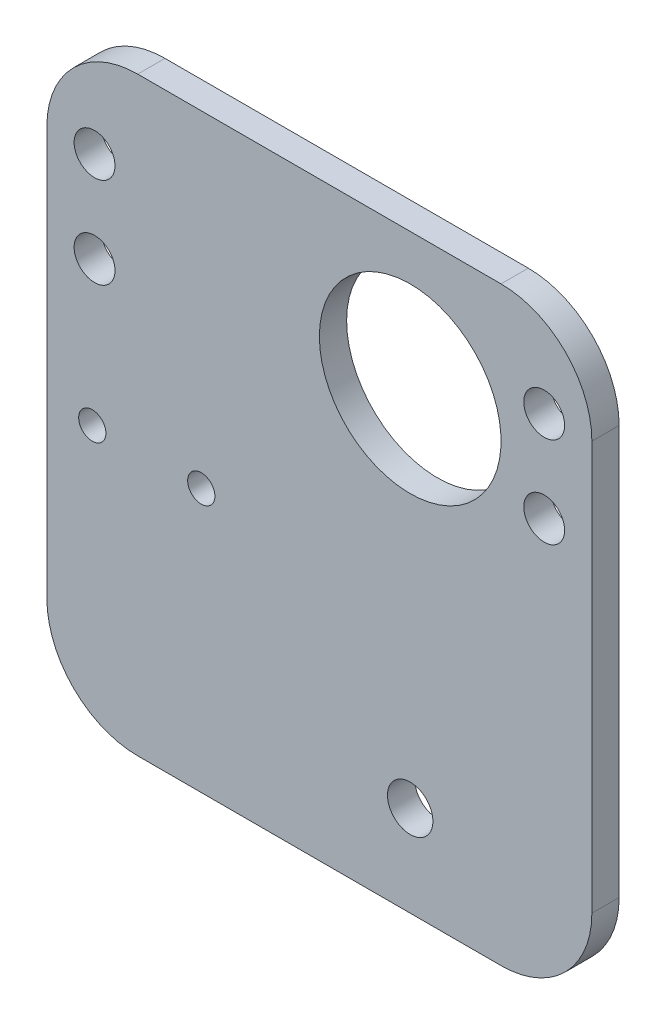
ISO-10303-21;
HEADER;
FILE_DESCRIPTION(('STEP AP214'),'2;1');
FILE_NAME('part.step','',(''),(''),'','','');
FILE_SCHEMA(('AUTOMOTIVE_DESIGN { 1 0 10303 214 1 1 1 1 }'));
ENDSEC;
DATA;
#1=APPLICATION_CONTEXT('core data for automotive mechanical design processes');
#2=APPLICATION_PROTOCOL_DEFINITION('international standard','automotive_design',2000,#1);
#3=PRODUCT_CONTEXT('',#1,'mechanical');
#4=PRODUCT('Part','Part','',(#3));
#5=PRODUCT_RELATED_PRODUCT_CATEGORY('part','',(#4));
#6=PRODUCT_DEFINITION_FORMATION('','',#4);
#7=PRODUCT_DEFINITION_CONTEXT('part definition',#1,'design');
#8=PRODUCT_DEFINITION('design','',#6,#7);
#9=PRODUCT_DEFINITION_SHAPE('','',#8);
#10=(LENGTH_UNIT() NAMED_UNIT(*) SI_UNIT(.MILLI.,.METRE.));
#11=(NAMED_UNIT(*) PLANE_ANGLE_UNIT() SI_UNIT($,.RADIAN.));
#12=(NAMED_UNIT(*) SI_UNIT($,.STERADIAN.) SOLID_ANGLE_UNIT());
#13=UNCERTAINTY_MEASURE_WITH_UNIT(LENGTH_MEASURE(1.E-05),#10,'distance_accuracy_value','');
#14=(GEOMETRIC_REPRESENTATION_CONTEXT(3) GLOBAL_UNCERTAINTY_ASSIGNED_CONTEXT((#13)) GLOBAL_UNIT_ASSIGNED_CONTEXT((#10,
#11,#12)) REPRESENTATION_CONTEXT('',''));
#15=CARTESIAN_POINT('',(0.,0.,0.));
#16=DIRECTION('',(0.,0.,1.));
#17=DIRECTION('',(1.,0.,0.));
#18=AXIS2_PLACEMENT_3D('',#15,#16,#17);
#19=CARTESIAN_POINT('',(0.,0.,0.001));
#20=DIRECTION('',(0.,0.,1.));
#21=DIRECTION('',(1.,0.,0.));
#22=AXIS2_PLACEMENT_3D('',#19,#20,#21);
#23=PLANE('',#22);
#24=CARTESIAN_POINT('',(45.5164785410153,-28.4674981786718,0.001));
#25=DIRECTION('',(0.,0.,-1.));
#26=DIRECTION('',(-1.,0.,0.));
#27=AXIS2_PLACEMENT_3D('',#24,#25,#26);
#28=CIRCLE('',#27,2.5);
#29=CARTESIAN_POINT('',(43.0164785410153,-28.4674981786718,0.001));
#30=VERTEX_POINT('',#29);
#31=EDGE_CURVE('E264',#30,#30,#28,.T.);
#32=ORIENTED_EDGE('',*,*,#31,.F.);
#33=EDGE_LOOP('',(#32));
#34=FACE_BOUND('',#33,.T.);
#35=CARTESIAN_POINT('',(45.5164785410153,-28.4674981786718,0.000999999999999916));
#36=DIRECTION('',(0.,0.,1.));
#37=DIRECTION('',(1.,0.,0.));
#38=AXIS2_PLACEMENT_3D('',#35,#36,#37);
#39=CIRCLE('',#38,7.5);
#40=CARTESIAN_POINT('',(53.0164785410153,-28.4674981786718,0.000999999999999916));
#41=VERTEX_POINT('',#40);
#42=EDGE_CURVE('E127',#41,#41,#39,.T.);
#43=ORIENTED_EDGE('',*,*,#42,.F.);
#44=EDGE_LOOP('',(#43));
#45=FACE_BOUND('',#44,.T.);
#46=ADVANCED_FACE('F35',(#34,#45),#23,.F.);
#47=CARTESIAN_POINT('',(45.5164785410153,-28.4674981786718,0.000999999999999916));
#48=DIRECTION('',(0.,0.,1.));
#49=DIRECTION('',(1.,0.,0.));
#50=AXIS2_PLACEMENT_3D('',#47,#48,#49);
#51=CIRCLE('',#50,9.5);
#52=CARTESIAN_POINT('',(55.0164785410153,-28.4674981786718,0.000999999999999916));
#53=VERTEX_POINT('',#52);
#54=EDGE_CURVE('E377',#53,#53,#51,.T.);
#55=ORIENTED_EDGE('',*,*,#54,.T.);
#56=EDGE_LOOP('',(#55));
#57=FACE_BOUND('',#56,.T.);
#58=CARTESIAN_POINT('',(10.5164785410153,-9.46749817867184,0.00100000000000013));
#59=DIRECTION('',(0.,0.,1.));
#60=DIRECTION('',(1.,0.,0.));
#61=AXIS2_PLACEMENT_3D('',#58,#59,#60);
#62=CIRCLE('',#61,1.5);
#63=CARTESIAN_POINT('',(12.0164785410153,-9.46749817867184,0.00100000000000013));
#64=VERTEX_POINT('',#63);
#65=EDGE_CURVE('E270',#64,#64,#62,.T.);
#66=ORIENTED_EDGE('',*,*,#65,.T.);
#67=EDGE_LOOP('',(#66));
#68=FACE_BOUND('',#67,.T.);
#69=CARTESIAN_POINT('',(22.5164785410153,-9.46749817867184,0.00100000000000013));
#70=DIRECTION('',(0.,0.,1.));
#71=DIRECTION('',(1.,0.,0.));
#72=AXIS2_PLACEMENT_3D('',#69,#70,#71);
#73=CIRCLE('',#72,1.5);
#74=CARTESIAN_POINT('',(24.0164785410153,-9.46749817867184,0.00100000000000013));
#75=VERTEX_POINT('',#74);
#76=EDGE_CURVE('E385',#75,#75,#73,.T.);
#77=ORIENTED_EDGE('',*,*,#76,.T.);
#78=EDGE_LOOP('',(#77));
#79=FACE_BOUND('',#78,.T.);
#80=CARTESIAN_POINT('',(45.5164785410153,11.5325018213282,0.001));
#81=DIRECTION('',(0.,0.,-1.));
#82=DIRECTION('',(-1.,0.,0.));
#83=AXIS2_PLACEMENT_3D('',#80,#81,#82);
#84=CIRCLE('',#83,10.);
#85=CARTESIAN_POINT('',(35.5164785410153,11.5325018213282,0.001));
#86=VERTEX_POINT('',#85);
#87=EDGE_CURVE('E263',#86,#86,#84,.T.);
#88=ORIENTED_EDGE('',*,*,#87,.F.);
#89=EDGE_LOOP('',(#88));
#90=FACE_BOUND('',#89,.T.);
#91=CARTESIAN_POINT('',(60.2664785410153,6.53250182132816,0.001));
#92=DIRECTION('',(0.,0.,1.));
#93=DIRECTION('',(1.,0.,0.));
#94=AXIS2_PLACEMENT_3D('',#91,#92,#93);
#95=CIRCLE('',#94,3.00000000000002);
#96=CARTESIAN_POINT('',(63.2664785410153,6.53250182132816,0.001));
#97=VERTEX_POINT('',#96);
#98=EDGE_CURVE('E187',#97,#97,#95,.F.);
#99=ORIENTED_EDGE('',*,*,#98,.F.);
#100=EDGE_LOOP('',(#99));
#101=FACE_BOUND('',#100,.T.);
#102=DIRECTION('',(1.,0.,0.));
#103=VECTOR('',#102,1.);
#104=CARTESIAN_POINT('',(5.51647854101529,26.5325018213282,0.001));
#105=LINE('',#104,#103);
#106=CARTESIAN_POINT('',(15.5164785410153,26.5325018213282,0.001));
#107=VERTEX_POINT('',#106);
#108=CARTESIAN_POINT('',(55.5164785410153,26.5325018213282,0.001));
#109=VERTEX_POINT('',#108);
#110=EDGE_CURVE('E105',#107,#109,#105,.T.);
#111=ORIENTED_EDGE('',*,*,#110,.T.);
#112=CARTESIAN_POINT('',(55.5164785410153,16.5325018213282,0.00100000000000013));
#113=DIRECTION('',(0.,0.,1.));
#114=DIRECTION('',(1.,0.,0.));
#115=AXIS2_PLACEMENT_3D('',#112,#113,#114);
#116=CIRCLE('',#115,10.);
#117=CARTESIAN_POINT('',(65.5164785410153,16.5325018213282,0.001));
#118=VERTEX_POINT('',#117);
#119=EDGE_CURVE('E139',#109,#118,#116,.F.);
#120=ORIENTED_EDGE('',*,*,#119,.T.);
#121=DIRECTION('',(0.,-1.,0.));
#122=VECTOR('',#121,1.);
#123=CARTESIAN_POINT('',(65.5164785410153,26.5325018213282,0.001));
#124=LINE('',#123,#122);
#125=CARTESIAN_POINT('',(65.5164785410153,-28.4674981786718,0.001));
#126=VERTEX_POINT('',#125);
#127=EDGE_CURVE('E123',#118,#126,#124,.T.);
#128=ORIENTED_EDGE('',*,*,#127,.T.);
#129=CARTESIAN_POINT('',(55.5164785410153,-28.4674981786718,0.00100000000000013));
#130=DIRECTION('',(0.,0.,1.));
#131=DIRECTION('',(1.,0.,0.));
#132=AXIS2_PLACEMENT_3D('',#129,#130,#131);
#133=CIRCLE('',#132,10.);
#134=CARTESIAN_POINT('',(55.5164785410153,-38.4674981786718,0.001));
#135=VERTEX_POINT('',#134);
#136=EDGE_CURVE('E137',#126,#135,#133,.F.);
#137=ORIENTED_EDGE('',*,*,#136,.T.);
#138=DIRECTION('',(1.,0.,0.));
#139=VECTOR('',#138,1.);
#140=CARTESIAN_POINT('',(5.51647854101529,-38.4674981786718,0.001));
#141=LINE('',#140,#139);
#142=CARTESIAN_POINT('',(15.5164785410153,-38.4674981786718,0.001));
#143=VERTEX_POINT('',#142);
#144=EDGE_CURVE('E173',#143,#135,#141,.T.);
#145=ORIENTED_EDGE('',*,*,#144,.F.);
#146=CARTESIAN_POINT('',(15.5164785410153,-28.4674981786718,0.00100000000000013));
#147=DIRECTION('',(0.,0.,1.));
#148=DIRECTION('',(1.,0.,0.));
#149=AXIS2_PLACEMENT_3D('',#146,#147,#148);
#150=CIRCLE('',#149,10.);
#151=CARTESIAN_POINT('',(5.51647854101529,-28.4674981786718,0.001));
#152=VERTEX_POINT('',#151);
#153=EDGE_CURVE('E112',#143,#152,#150,.F.);
#154=ORIENTED_EDGE('',*,*,#153,.T.);
#155=DIRECTION('',(0.,-1.,0.));
#156=VECTOR('',#155,1.);
#157=CARTESIAN_POINT('',(5.51647854101529,1.53250182132815,0.001));
#158=LINE('',#157,#156);
#159=CARTESIAN_POINT('',(5.51647854101529,16.5325018213282,0.001));
#160=VERTEX_POINT('',#159);
#161=EDGE_CURVE('E107',#160,#152,#158,.T.);
#162=ORIENTED_EDGE('',*,*,#161,.F.);
#163=CARTESIAN_POINT('',(15.5164785410153,16.5325018213282,0.00100000000000013));
#164=DIRECTION('',(0.,0.,1.));
#165=DIRECTION('',(1.,0.,0.));
#166=AXIS2_PLACEMENT_3D('',#163,#164,#165);
#167=CIRCLE('',#166,10.);
#168=EDGE_CURVE('E101',#160,#107,#167,.F.);
#169=ORIENTED_EDGE('',*,*,#168,.T.);
#170=EDGE_LOOP('',(#111,#120,#128,#137,#145,#154,#162,#169));
#171=FACE_BOUND('',#170,.T.);
#172=CARTESIAN_POINT('',(10.7664785410153,6.53250182132816,0.001));
#173=DIRECTION('',(0.,0.,1.));
#174=DIRECTION('',(1.,0.,0.));
#175=AXIS2_PLACEMENT_3D('',#172,#173,#174);
#176=CIRCLE('',#175,3.);
#177=CARTESIAN_POINT('',(13.7664785410153,6.53250182132816,0.001));
#178=VERTEX_POINT('',#177);
#179=EDGE_CURVE('E180',#178,#178,#176,.T.);
#180=ORIENTED_EDGE('',*,*,#179,.T.);
#181=EDGE_LOOP('',(#180));
#182=FACE_BOUND('',#181,.T.);
#183=CARTESIAN_POINT('',(60.2664785410153,16.5325018213282,0.001));
#184=DIRECTION('',(0.,0.,1.));
#185=DIRECTION('',(1.,0.,0.));
#186=AXIS2_PLACEMENT_3D('',#183,#184,#185);
#187=CIRCLE('',#186,3.00000000000002);
#188=CARTESIAN_POINT('',(63.2664785410153,16.5325018213282,0.001));
#189=VERTEX_POINT('',#188);
#190=EDGE_CURVE('E183',#189,#189,#187,.F.);
#191=ORIENTED_EDGE('',*,*,#190,.F.);
#192=EDGE_LOOP('',(#191));
#193=FACE_BOUND('',#192,.T.);
#194=CARTESIAN_POINT('',(10.7664785410153,16.5325018213282,0.001));
#195=DIRECTION('',(0.,0.,1.));
#196=DIRECTION('',(1.,0.,0.));
#197=AXIS2_PLACEMENT_3D('',#194,#195,#196);
#198=CIRCLE('',#197,3.);
#199=CARTESIAN_POINT('',(13.7664785410153,16.5325018213282,0.001));
#200=VERTEX_POINT('',#199);
#201=EDGE_CURVE('E131',#200,#200,#198,.F.);
#202=ORIENTED_EDGE('',*,*,#201,.F.);
#203=EDGE_LOOP('',(#202));
#204=FACE_BOUND('',#203,.T.);
#205=ADVANCED_FACE('F103',(#57,#68,#79,#90,#101,#171,#182,#193,#204),#23,.F.);
#206=CARTESIAN_POINT('',(10.7664785410153,6.53250182132816,0.001));
#207=DIRECTION('',(0.,0.,-1.));
#208=DIRECTION('',(-1.,0.,0.));
#209=AXIS2_PLACEMENT_3D('',#206,#207,#208);
#210=CYLINDRICAL_SURFACE('',#209,3.);
#211=ORIENTED_EDGE('',*,*,#179,.F.);
#212=EDGE_LOOP('',(#211));
#213=FACE_BOUND('',#212,.T.);
#214=CARTESIAN_POINT('',(10.7664785410153,6.53250182132816,0.));
#215=DIRECTION('',(0.,0.,1.));
#216=DIRECTION('',(1.,0.,0.));
#217=AXIS2_PLACEMENT_3D('',#214,#215,#216);
#218=CIRCLE('',#217,3.);
#219=CARTESIAN_POINT('',(13.7664785410153,6.53250182132816,0.));
#220=VERTEX_POINT('',#219);
#221=EDGE_CURVE('E179',#220,#220,#218,.T.);
#222=ORIENTED_EDGE('',*,*,#221,.T.);
#223=EDGE_LOOP('',(#222));
#224=FACE_BOUND('',#223,.T.);
#225=ADVANCED_FACE('F198',(#213,#224),#210,.T.);
#226=CARTESIAN_POINT('',(10.7664785410153,6.53250182132816,0.));
#227=DIRECTION('',(0.,0.,1.));
#228=DIRECTION('',(1.,0.,0.));
#229=AXIS2_PLACEMENT_3D('',#226,#227,#228);
#230=PLANE('',#229);
#231=CARTESIAN_POINT('',(10.7664785410153,6.53250182132816,0.));
#232=DIRECTION('',(0.,0.,1.));
#233=DIRECTION('',(1.,0.,0.));
#234=AXIS2_PLACEMENT_3D('',#231,#232,#233);
#235=CIRCLE('',#234,2.25);
#236=CARTESIAN_POINT('',(13.0164785410153,6.53250182132816,0.));
#237=VERTEX_POINT('',#236);
#238=EDGE_CURVE('E171',#237,#237,#235,.T.);
#239=ORIENTED_EDGE('',*,*,#238,.T.);
#240=EDGE_LOOP('',(#239));
#241=FACE_BOUND('',#240,.T.);
#242=ORIENTED_EDGE('',*,*,#221,.F.);
#243=EDGE_LOOP('',(#242));
#244=FACE_BOUND('',#243,.T.);
#245=ADVANCED_FACE('F205',(#241,#244),#230,.F.);
#246=CARTESIAN_POINT('',(10.7664785410153,6.53250182132816,0.));
#247=DIRECTION('',(0.,0.,1.));
#248=DIRECTION('',(1.,0.,0.));
#249=AXIS2_PLACEMENT_3D('',#246,#247,#248);
#250=CYLINDRICAL_SURFACE('',#249,2.25);
#251=ORIENTED_EDGE('',*,*,#238,.F.);
#252=EDGE_LOOP('',(#251));
#253=FACE_BOUND('',#252,.T.);
#254=CARTESIAN_POINT('',(10.7664785410153,6.53250182132816,3.001));
#255=DIRECTION('',(0.,0.,-1.));
#256=DIRECTION('',(-1.,0.,0.));
#257=AXIS2_PLACEMENT_3D('',#254,#255,#256);
#258=CIRCLE('',#257,2.25);
#259=CARTESIAN_POINT('',(8.51647854101528,6.53250182132816,3.001));
#260=VERTEX_POINT('',#259);
#261=EDGE_CURVE('E278',#260,#260,#258,.T.);
#262=ORIENTED_EDGE('',*,*,#261,.F.);
#263=EDGE_LOOP('',(#262));
#264=FACE_BOUND('',#263,.T.);
#265=ADVANCED_FACE('F227',(#253,#264),#250,.F.);
#266=CARTESIAN_POINT('',(0.,0.,3.001));
#267=DIRECTION('',(0.,0.,1.));
#268=DIRECTION('',(1.,0.,0.));
#269=AXIS2_PLACEMENT_3D('',#266,#267,#268);
#270=PLANE('',#269);
#271=CARTESIAN_POINT('',(10.5164785410153,-9.46749817867184,3.001));
#272=DIRECTION('',(0.,0.,1.));
#273=DIRECTION('',(1.,0.,0.));
#274=AXIS2_PLACEMENT_3D('',#271,#272,#273);
#275=CIRCLE('',#274,1.5);
#276=CARTESIAN_POINT('',(12.0164785410153,-9.46749817867184,3.001));
#277=VERTEX_POINT('',#276);
#278=EDGE_CURVE('E382',#277,#277,#275,.T.);
#279=ORIENTED_EDGE('',*,*,#278,.F.);
#280=EDGE_LOOP('',(#279));
#281=FACE_BOUND('',#280,.T.);
#282=CARTESIAN_POINT('',(22.5164785410153,-9.46749817867184,3.001));
#283=DIRECTION('',(0.,0.,1.));
#284=DIRECTION('',(1.,0.,0.));
#285=AXIS2_PLACEMENT_3D('',#282,#283,#284);
#286=CIRCLE('',#285,1.5);
#287=CARTESIAN_POINT('',(24.0164785410153,-9.46749817867184,3.001));
#288=VERTEX_POINT('',#287);
#289=EDGE_CURVE('E381',#288,#288,#286,.T.);
#290=ORIENTED_EDGE('',*,*,#289,.F.);
#291=EDGE_LOOP('',(#290));
#292=FACE_BOUND('',#291,.T.);
#293=CARTESIAN_POINT('',(60.2664785410153,16.5325018213282,3.001));
#294=DIRECTION('',(0.,0.,-1.));
#295=DIRECTION('',(-1.,0.,0.));
#296=AXIS2_PLACEMENT_3D('',#293,#294,#295);
#297=CIRCLE('',#296,2.25);
#298=CARTESIAN_POINT('',(58.0164785410153,16.5325018213282,3.001));
#299=VERTEX_POINT('',#298);
#300=EDGE_CURVE('E281',#299,#299,#297,.T.);
#301=ORIENTED_EDGE('',*,*,#300,.T.);
#302=EDGE_LOOP('',(#301));
#303=FACE_BOUND('',#302,.T.);
#304=ORIENTED_EDGE('',*,*,#261,.T.);
#305=EDGE_LOOP('',(#304));
#306=FACE_BOUND('',#305,.T.);
#307=CARTESIAN_POINT('',(10.7664785410153,16.5325018213282,3.001));
#308=DIRECTION('',(0.,0.,-1.));
#309=DIRECTION('',(-1.,0.,0.));
#310=AXIS2_PLACEMENT_3D('',#307,#308,#309);
#311=CIRCLE('',#310,2.25);
#312=CARTESIAN_POINT('',(8.51647854101528,16.5325018213282,3.001));
#313=VERTEX_POINT('',#312);
#314=EDGE_CURVE('E275',#313,#313,#311,.T.);
#315=ORIENTED_EDGE('',*,*,#314,.T.);
#316=EDGE_LOOP('',(#315));
#317=FACE_BOUND('',#316,.T.);
#318=CARTESIAN_POINT('',(45.5164785410153,11.5325018213282,3.001));
#319=DIRECTION('',(0.,0.,-1.));
#320=DIRECTION('',(-1.,0.,0.));
#321=AXIS2_PLACEMENT_3D('',#318,#319,#320);
#322=CIRCLE('',#321,10.);
#323=CARTESIAN_POINT('',(35.5164785410153,11.5325018213282,3.001));
#324=VERTEX_POINT('',#323);
#325=EDGE_CURVE('E267',#324,#324,#322,.T.);
#326=ORIENTED_EDGE('',*,*,#325,.T.);
#327=EDGE_LOOP('',(#326));
#328=FACE_BOUND('',#327,.T.);
#329=CARTESIAN_POINT('',(60.2664785410153,6.53250182132816,3.001));
#330=DIRECTION('',(0.,0.,-1.));
#331=DIRECTION('',(-1.,0.,0.));
#332=AXIS2_PLACEMENT_3D('',#329,#330,#331);
#333=CIRCLE('',#332,2.25);
#334=CARTESIAN_POINT('',(58.0164785410153,6.53250182132816,3.001));
#335=VERTEX_POINT('',#334);
#336=EDGE_CURVE('E284',#335,#335,#333,.T.);
#337=ORIENTED_EDGE('',*,*,#336,.T.);
#338=EDGE_LOOP('',(#337));
#339=FACE_BOUND('',#338,.T.);
#340=DIRECTION('',(0.,-1.,0.));
#341=VECTOR('',#340,1.);
#342=CARTESIAN_POINT('',(65.5164785410153,26.5325018213282,3.001));
#343=LINE('',#342,#341);
#344=CARTESIAN_POINT('',(65.5164785410153,16.5325018213282,3.001));
#345=VERTEX_POINT('',#344);
#346=CARTESIAN_POINT('',(65.5164785410153,-28.4674981786718,3.001));
#347=VERTEX_POINT('',#346);
#348=EDGE_CURVE('E161',#345,#347,#343,.T.);
#349=ORIENTED_EDGE('',*,*,#348,.F.);
#350=CARTESIAN_POINT('',(55.5164785410153,16.5325018213282,3.001));
#351=DIRECTION('',(0.,0.,1.));
#352=DIRECTION('',(1.,0.,0.));
#353=AXIS2_PLACEMENT_3D('',#350,#351,#352);
#354=CIRCLE('',#353,10.);
#355=CARTESIAN_POINT('',(55.5164785410153,26.5325018213282,3.001));
#356=VERTEX_POINT('',#355);
#357=EDGE_CURVE('E150',#345,#356,#354,.T.);
#358=ORIENTED_EDGE('',*,*,#357,.T.);
#359=DIRECTION('',(1.,0.,0.));
#360=VECTOR('',#359,1.);
#361=CARTESIAN_POINT('',(5.51647854101529,26.5325018213282,3.001));
#362=LINE('',#361,#360);
#363=CARTESIAN_POINT('',(15.5164785410153,26.5325018213282,3.001));
#364=VERTEX_POINT('',#363);
#365=EDGE_CURVE('E169',#364,#356,#362,.T.);
#366=ORIENTED_EDGE('',*,*,#365,.F.);
#367=CARTESIAN_POINT('',(15.5164785410153,16.5325018213282,3.001));
#368=DIRECTION('',(0.,0.,1.));
#369=DIRECTION('',(1.,0.,0.));
#370=AXIS2_PLACEMENT_3D('',#367,#368,#369);
#371=CIRCLE('',#370,10.);
#372=CARTESIAN_POINT('',(5.51647854101529,16.5325018213282,3.001));
#373=VERTEX_POINT('',#372);
#374=EDGE_CURVE('E126',#364,#373,#371,.T.);
#375=ORIENTED_EDGE('',*,*,#374,.T.);
#376=DIRECTION('',(0.,-1.,0.));
#377=VECTOR('',#376,1.);
#378=CARTESIAN_POINT('',(5.51647854101529,26.5325018213282,3.001));
#379=LINE('',#378,#377);
#380=CARTESIAN_POINT('',(5.51647854101529,-28.4674981786718,3.001));
#381=VERTEX_POINT('',#380);
#382=EDGE_CURVE('E122',#373,#381,#379,.T.);
#383=ORIENTED_EDGE('',*,*,#382,.T.);
#384=CARTESIAN_POINT('',(15.5164785410153,-28.4674981786718,3.001));
#385=DIRECTION('',(0.,0.,1.));
#386=DIRECTION('',(1.,0.,0.));
#387=AXIS2_PLACEMENT_3D('',#384,#385,#386);
#388=CIRCLE('',#387,10.);
#389=CARTESIAN_POINT('',(15.5164785410153,-38.4674981786718,3.001));
#390=VERTEX_POINT('',#389);
#391=EDGE_CURVE('E57',#381,#390,#388,.T.);
#392=ORIENTED_EDGE('',*,*,#391,.T.);
#393=DIRECTION('',(1.,0.,0.));
#394=VECTOR('',#393,1.);
#395=CARTESIAN_POINT('',(5.51647854101529,-38.4674981786718,3.001));
#396=LINE('',#395,#394);
#397=CARTESIAN_POINT('',(55.5164785410153,-38.4674981786718,3.001));
#398=VERTEX_POINT('',#397);
#399=EDGE_CURVE('E159',#390,#398,#396,.T.);
#400=ORIENTED_EDGE('',*,*,#399,.T.);
#401=CARTESIAN_POINT('',(55.5164785410153,-28.4674981786718,3.001));
#402=DIRECTION('',(0.,0.,1.));
#403=DIRECTION('',(1.,0.,0.));
#404=AXIS2_PLACEMENT_3D('',#401,#402,#403);
#405=CIRCLE('',#404,10.);
#406=EDGE_CURVE('E148',#398,#347,#405,.T.);
#407=ORIENTED_EDGE('',*,*,#406,.T.);
#408=EDGE_LOOP('',(#349,#358,#366,#375,#383,#392,#400,#407));
#409=FACE_BOUND('',#408,.T.);
#410=CARTESIAN_POINT('',(45.5164785410153,-28.4674981786718,3.001));
#411=DIRECTION('',(0.,0.,-1.));
#412=DIRECTION('',(-1.,0.,0.));
#413=AXIS2_PLACEMENT_3D('',#410,#411,#412);
#414=CIRCLE('',#413,2.5);
#415=CARTESIAN_POINT('',(43.0164785410153,-28.4674981786718,3.001));
#416=VERTEX_POINT('',#415);
#417=EDGE_CURVE('E261',#416,#416,#414,.T.);
#418=ORIENTED_EDGE('',*,*,#417,.T.);
#419=EDGE_LOOP('',(#418));
#420=FACE_BOUND('',#419,.T.);
#421=ADVANCED_FACE('F213',(#281,#292,#303,#306,#317,#328,#339,#409,#420),#270,.T.);
#422=CARTESIAN_POINT('',(5.51647854101529,26.5325018213282,3.001));
#423=DIRECTION('',(0.,1.,0.));
#424=DIRECTION('',(0.,0.,1.));
#425=AXIS2_PLACEMENT_3D('',#422,#423,#424);
#426=PLANE('',#425);
#427=ORIENTED_EDGE('',*,*,#365,.T.);
#428=DIRECTION('',(0.,0.,-1.));
#429=VECTOR('',#428,1.);
#430=CARTESIAN_POINT('',(55.5164785410153,26.5325018213282,3.001));
#431=LINE('',#430,#429);
#432=EDGE_CURVE('E113',#356,#109,#431,.T.);
#433=ORIENTED_EDGE('',*,*,#432,.T.);
#434=ORIENTED_EDGE('',*,*,#110,.F.);
#435=DIRECTION('',(0.,0.,-1.));
#436=VECTOR('',#435,1.);
#437=CARTESIAN_POINT('',(15.5164785410153,26.5325018213282,3.001));
#438=LINE('',#437,#436);
#439=EDGE_CURVE('E119',#107,#364,#438,.F.);
#440=ORIENTED_EDGE('',*,*,#439,.T.);
#441=EDGE_LOOP('',(#427,#433,#434,#440));
#442=FACE_BOUND('',#441,.T.);
#443=ADVANCED_FACE('F118',(#442),#426,.T.);
#444=CARTESIAN_POINT('',(65.5164785410153,26.5325018213282,3.001));
#445=DIRECTION('',(1.,0.,0.));
#446=DIRECTION('',(0.,0.,-1.));
#447=AXIS2_PLACEMENT_3D('',#444,#445,#446);
#448=PLANE('',#447);
#449=ORIENTED_EDGE('',*,*,#127,.F.);
#450=DIRECTION('',(0.,0.,-1.));
#451=VECTOR('',#450,1.);
#452=CARTESIAN_POINT('',(65.5164785410153,16.5325018213282,3.001));
#453=LINE('',#452,#451);
#454=EDGE_CURVE('E144',#118,#345,#453,.F.);
#455=ORIENTED_EDGE('',*,*,#454,.T.);
#456=ORIENTED_EDGE('',*,*,#348,.T.);
#457=DIRECTION('',(0.,0.,-1.));
#458=VECTOR('',#457,1.);
#459=CARTESIAN_POINT('',(65.5164785410153,-28.4674981786718,0.00100000000000013));
#460=LINE('',#459,#458);
#461=EDGE_CURVE('E141',#347,#126,#460,.T.);
#462=ORIENTED_EDGE('',*,*,#461,.T.);
#463=EDGE_LOOP('',(#449,#455,#456,#462));
#464=FACE_BOUND('',#463,.T.);
#465=ADVANCED_FACE('F217',(#464),#448,.T.);
#466=CARTESIAN_POINT('',(5.51647854101529,-38.4674981786718,3.001));
#467=DIRECTION('',(0.,1.,0.));
#468=DIRECTION('',(0.,0.,1.));
#469=AXIS2_PLACEMENT_3D('',#466,#467,#468);
#470=PLANE('',#469);
#471=ORIENTED_EDGE('',*,*,#144,.T.);
#472=DIRECTION('',(0.,0.,-1.));
#473=VECTOR('',#472,1.);
#474=CARTESIAN_POINT('',(55.5164785410153,-38.4674981786718,3.001));
#475=LINE('',#474,#473);
#476=EDGE_CURVE('E50',#135,#398,#475,.F.);
#477=ORIENTED_EDGE('',*,*,#476,.T.);
#478=ORIENTED_EDGE('',*,*,#399,.F.);
#479=DIRECTION('',(0.,0.,-1.));
#480=VECTOR('',#479,1.);
#481=CARTESIAN_POINT('',(15.5164785410153,-38.4674981786718,3.001));
#482=LINE('',#481,#480);
#483=EDGE_CURVE('E152',#390,#143,#482,.T.);
#484=ORIENTED_EDGE('',*,*,#483,.T.);
#485=EDGE_LOOP('',(#471,#477,#478,#484));
#486=FACE_BOUND('',#485,.T.);
#487=ADVANCED_FACE('F220',(#486),#470,.F.);
#488=CARTESIAN_POINT('',(5.51647854101529,1.53250182132815,3.001));
#489=DIRECTION('',(1.,0.,0.));
#490=DIRECTION('',(0.,1.,0.));
#491=AXIS2_PLACEMENT_3D('',#488,#489,#490);
#492=PLANE('',#491);
#493=ORIENTED_EDGE('',*,*,#161,.T.);
#494=DIRECTION('',(0.,0.,-1.));
#495=VECTOR('',#494,1.);
#496=CARTESIAN_POINT('',(5.51647854101529,-28.4674981786718,3.001));
#497=LINE('',#496,#495);
#498=EDGE_CURVE('E11',#152,#381,#497,.F.);
#499=ORIENTED_EDGE('',*,*,#498,.T.);
#500=ORIENTED_EDGE('',*,*,#382,.F.);
#501=DIRECTION('',(0.,0.,-1.));
#502=VECTOR('',#501,1.);
#503=CARTESIAN_POINT('',(5.51647854101529,16.5325018213282,0.00100000000000013));
#504=LINE('',#503,#502);
#505=EDGE_CURVE('E43',#373,#160,#504,.T.);
#506=ORIENTED_EDGE('',*,*,#505,.T.);
#507=EDGE_LOOP('',(#493,#499,#500,#506));
#508=FACE_BOUND('',#507,.T.);
#509=ADVANCED_FACE('F157',(#508),#492,.F.);
#510=CARTESIAN_POINT('',(60.2664785410153,16.5325018213282,0.001));
#511=DIRECTION('',(0.,0.,-1.));
#512=DIRECTION('',(-1.,0.,0.));
#513=AXIS2_PLACEMENT_3D('',#510,#511,#512);
#514=CYLINDRICAL_SURFACE('',#513,3.00000000000002);
#515=ORIENTED_EDGE('',*,*,#190,.T.);
#516=EDGE_LOOP('',(#515));
#517=FACE_BOUND('',#516,.T.);
#518=CARTESIAN_POINT('',(60.2664785410153,16.5325018213282,0.));
#519=DIRECTION('',(0.,0.,1.));
#520=DIRECTION('',(1.,0.,0.));
#521=AXIS2_PLACEMENT_3D('',#518,#519,#520);
#522=CIRCLE('',#521,3.00000000000002);
#523=CARTESIAN_POINT('',(63.2664785410153,16.5325018213282,0.));
#524=VERTEX_POINT('',#523);
#525=EDGE_CURVE('E164',#524,#524,#522,.T.);
#526=ORIENTED_EDGE('',*,*,#525,.T.);
#527=EDGE_LOOP('',(#526));
#528=FACE_BOUND('',#527,.T.);
#529=ADVANCED_FACE('F226',(#517,#528),#514,.T.);
#530=CARTESIAN_POINT('',(60.2664785410153,16.5325018213282,0.));
#531=DIRECTION('',(0.,0.,1.));
#532=DIRECTION('',(1.,0.,0.));
#533=AXIS2_PLACEMENT_3D('',#530,#531,#532);
#534=PLANE('',#533);
#535=CARTESIAN_POINT('',(60.2664785410153,16.5325018213282,0.));
#536=DIRECTION('',(0.,0.,1.));
#537=DIRECTION('',(1.,0.,0.));
#538=AXIS2_PLACEMENT_3D('',#535,#536,#537);
#539=CIRCLE('',#538,2.25);
#540=CARTESIAN_POINT('',(62.5164785410153,16.5325018213282,0.));
#541=VERTEX_POINT('',#540);
#542=EDGE_CURVE('E300',#541,#541,#539,.T.);
#543=ORIENTED_EDGE('',*,*,#542,.T.);
#544=EDGE_LOOP('',(#543));
#545=FACE_BOUND('',#544,.T.);
#546=ORIENTED_EDGE('',*,*,#525,.F.);
#547=EDGE_LOOP('',(#546));
#548=FACE_BOUND('',#547,.T.);
#549=ADVANCED_FACE('F308',(#545,#548),#534,.F.);
#550=CARTESIAN_POINT('',(60.2664785410153,16.5325018213282,0.));
#551=DIRECTION('',(0.,0.,1.));
#552=DIRECTION('',(1.,0.,0.));
#553=AXIS2_PLACEMENT_3D('',#550,#551,#552);
#554=CYLINDRICAL_SURFACE('',#553,2.25);
#555=ORIENTED_EDGE('',*,*,#542,.F.);
#556=EDGE_LOOP('',(#555));
#557=FACE_BOUND('',#556,.T.);
#558=ORIENTED_EDGE('',*,*,#300,.F.);
#559=EDGE_LOOP('',(#558));
#560=FACE_BOUND('',#559,.T.);
#561=ADVANCED_FACE('F310',(#557,#560),#554,.F.);
#562=CARTESIAN_POINT('',(60.2664785410153,6.53250182132816,0.001));
#563=DIRECTION('',(0.,0.,-1.));
#564=DIRECTION('',(-1.,0.,0.));
#565=AXIS2_PLACEMENT_3D('',#562,#563,#564);
#566=CYLINDRICAL_SURFACE('',#565,3.00000000000002);
#567=ORIENTED_EDGE('',*,*,#98,.T.);
#568=EDGE_LOOP('',(#567));
#569=FACE_BOUND('',#568,.T.);
#570=CARTESIAN_POINT('',(60.2664785410153,6.53250182132816,0.));
#571=DIRECTION('',(0.,0.,1.));
#572=DIRECTION('',(1.,0.,0.));
#573=AXIS2_PLACEMENT_3D('',#570,#571,#572);
#574=CIRCLE('',#573,3.00000000000002);
#575=CARTESIAN_POINT('',(63.2664785410153,6.53250182132816,0.));
#576=VERTEX_POINT('',#575);
#577=EDGE_CURVE('E298',#576,#576,#574,.T.);
#578=ORIENTED_EDGE('',*,*,#577,.T.);
#579=EDGE_LOOP('',(#578));
#580=FACE_BOUND('',#579,.T.);
#581=ADVANCED_FACE('F315',(#569,#580),#566,.T.);
#582=CARTESIAN_POINT('',(60.2664785410153,6.53250182132816,0.));
#583=DIRECTION('',(0.,0.,1.));
#584=DIRECTION('',(1.,0.,0.));
#585=AXIS2_PLACEMENT_3D('',#582,#583,#584);
#586=PLANE('',#585);
#587=CARTESIAN_POINT('',(60.2664785410153,6.53250182132816,0.));
#588=DIRECTION('',(0.,0.,1.));
#589=DIRECTION('',(1.,0.,0.));
#590=AXIS2_PLACEMENT_3D('',#587,#588,#589);
#591=CIRCLE('',#590,2.25);
#592=CARTESIAN_POINT('',(62.5164785410153,6.53250182132816,0.));
#593=VERTEX_POINT('',#592);
#594=EDGE_CURVE('E295',#593,#593,#591,.T.);
#595=ORIENTED_EDGE('',*,*,#594,.T.);
#596=EDGE_LOOP('',(#595));
#597=FACE_BOUND('',#596,.T.);
#598=ORIENTED_EDGE('',*,*,#577,.F.);
#599=EDGE_LOOP('',(#598));
#600=FACE_BOUND('',#599,.T.);
#601=ADVANCED_FACE('F321',(#597,#600),#586,.F.);
#602=CARTESIAN_POINT('',(60.2664785410153,6.53250182132816,0.));
#603=DIRECTION('',(0.,0.,1.));
#604=DIRECTION('',(1.,0.,0.));
#605=AXIS2_PLACEMENT_3D('',#602,#603,#604);
#606=CYLINDRICAL_SURFACE('',#605,2.25);
#607=ORIENTED_EDGE('',*,*,#594,.F.);
#608=EDGE_LOOP('',(#607));
#609=FACE_BOUND('',#608,.T.);
#610=ORIENTED_EDGE('',*,*,#336,.F.);
#611=EDGE_LOOP('',(#610));
#612=FACE_BOUND('',#611,.T.);
#613=ADVANCED_FACE('F324',(#609,#612),#606,.F.);
#614=CARTESIAN_POINT('',(10.7664785410153,16.5325018213282,0.001));
#615=DIRECTION('',(0.,0.,-1.));
#616=DIRECTION('',(-1.,0.,0.));
#617=AXIS2_PLACEMENT_3D('',#614,#615,#616);
#618=CYLINDRICAL_SURFACE('',#617,3.);
#619=ORIENTED_EDGE('',*,*,#201,.T.);
#620=EDGE_LOOP('',(#619));
#621=FACE_BOUND('',#620,.T.);
#622=CARTESIAN_POINT('',(10.7664785410153,16.5325018213282,0.));
#623=DIRECTION('',(0.,0.,1.));
#624=DIRECTION('',(1.,0.,0.));
#625=AXIS2_PLACEMENT_3D('',#622,#623,#624);
#626=CIRCLE('',#625,3.);
#627=CARTESIAN_POINT('',(13.7664785410153,16.5325018213282,0.));
#628=VERTEX_POINT('',#627);
#629=EDGE_CURVE('E292',#628,#628,#626,.T.);
#630=ORIENTED_EDGE('',*,*,#629,.T.);
#631=EDGE_LOOP('',(#630));
#632=FACE_BOUND('',#631,.T.);
#633=ADVANCED_FACE('F194',(#621,#632),#618,.T.);
#634=CARTESIAN_POINT('',(10.7664785410153,16.5325018213282,0.));
#635=DIRECTION('',(0.,0.,1.));
#636=DIRECTION('',(1.,0.,0.));
#637=AXIS2_PLACEMENT_3D('',#634,#635,#636);
#638=PLANE('',#637);
#639=CARTESIAN_POINT('',(10.7664785410153,16.5325018213282,0.));
#640=DIRECTION('',(0.,0.,1.));
#641=DIRECTION('',(1.,0.,0.));
#642=AXIS2_PLACEMENT_3D('',#639,#640,#641);
#643=CIRCLE('',#642,2.25);
#644=CARTESIAN_POINT('',(13.0164785410153,16.5325018213282,0.));
#645=VERTEX_POINT('',#644);
#646=EDGE_CURVE('E289',#645,#645,#643,.T.);
#647=ORIENTED_EDGE('',*,*,#646,.T.);
#648=EDGE_LOOP('',(#647));
#649=FACE_BOUND('',#648,.T.);
#650=ORIENTED_EDGE('',*,*,#629,.F.);
#651=EDGE_LOOP('',(#650));
#652=FACE_BOUND('',#651,.T.);
#653=ADVANCED_FACE('F331',(#649,#652),#638,.F.);
#654=CARTESIAN_POINT('',(10.7664785410153,16.5325018213282,0.));
#655=DIRECTION('',(0.,0.,1.));
#656=DIRECTION('',(1.,0.,0.));
#657=AXIS2_PLACEMENT_3D('',#654,#655,#656);
#658=CYLINDRICAL_SURFACE('',#657,2.25);
#659=ORIENTED_EDGE('',*,*,#646,.F.);
#660=EDGE_LOOP('',(#659));
#661=FACE_BOUND('',#660,.T.);
#662=ORIENTED_EDGE('',*,*,#314,.F.);
#663=EDGE_LOOP('',(#662));
#664=FACE_BOUND('',#663,.T.);
#665=ADVANCED_FACE('F334',(#661,#664),#658,.F.);
#666=CARTESIAN_POINT('',(45.5164785410153,11.5325018213282,3.001));
#667=DIRECTION('',(0.,0.,-1.));
#668=DIRECTION('',(-1.,0.,0.));
#669=AXIS2_PLACEMENT_3D('',#666,#667,#668);
#670=CYLINDRICAL_SURFACE('',#669,10.);
#671=ORIENTED_EDGE('',*,*,#325,.F.);
#672=EDGE_LOOP('',(#671));
#673=FACE_BOUND('',#672,.T.);
#674=ORIENTED_EDGE('',*,*,#87,.T.);
#675=EDGE_LOOP('',(#674));
#676=FACE_BOUND('',#675,.T.);
#677=ADVANCED_FACE('F340',(#673,#676),#670,.F.);
#678=CARTESIAN_POINT('',(45.5164785410153,-28.4674981786718,3.001));
#679=DIRECTION('',(0.,0.,-1.));
#680=DIRECTION('',(-1.,0.,0.));
#681=AXIS2_PLACEMENT_3D('',#678,#679,#680);
#682=CYLINDRICAL_SURFACE('',#681,2.5);
#683=ORIENTED_EDGE('',*,*,#417,.F.);
#684=EDGE_LOOP('',(#683));
#685=FACE_BOUND('',#684,.T.);
#686=ORIENTED_EDGE('',*,*,#31,.T.);
#687=EDGE_LOOP('',(#686));
#688=FACE_BOUND('',#687,.T.);
#689=ADVANCED_FACE('F344',(#685,#688),#682,.F.);
#690=CARTESIAN_POINT('',(22.5164785410153,-9.46749817867184,-6.999));
#691=DIRECTION('',(0.,0.,1.));
#692=DIRECTION('',(1.,0.,0.));
#693=AXIS2_PLACEMENT_3D('',#690,#691,#692);
#694=CYLINDRICAL_SURFACE('',#693,1.5);
#695=ORIENTED_EDGE('',*,*,#289,.T.);
#696=EDGE_LOOP('',(#695));
#697=FACE_BOUND('',#696,.T.);
#698=ORIENTED_EDGE('',*,*,#76,.F.);
#699=EDGE_LOOP('',(#698));
#700=FACE_BOUND('',#699,.T.);
#701=ADVANCED_FACE('F348',(#697,#700),#694,.F.);
#702=CARTESIAN_POINT('',(10.5164785410153,-9.46749817867184,-6.999));
#703=DIRECTION('',(0.,0.,1.));
#704=DIRECTION('',(1.,0.,0.));
#705=AXIS2_PLACEMENT_3D('',#702,#703,#704);
#706=CYLINDRICAL_SURFACE('',#705,1.5);
#707=ORIENTED_EDGE('',*,*,#278,.T.);
#708=EDGE_LOOP('',(#707));
#709=FACE_BOUND('',#708,.T.);
#710=ORIENTED_EDGE('',*,*,#65,.F.);
#711=EDGE_LOOP('',(#710));
#712=FACE_BOUND('',#711,.T.);
#713=ADVANCED_FACE('F351',(#709,#712),#706,.F.);
#714=CARTESIAN_POINT('',(45.5164785410153,-28.4674981786718,-1.899));
#715=DIRECTION('',(0.,0.,1.));
#716=DIRECTION('',(1.,0.,0.));
#717=AXIS2_PLACEMENT_3D('',#714,#715,#716);
#718=CYLINDRICAL_SURFACE('',#717,9.5);
#719=CARTESIAN_POINT('',(45.5164785410153,-28.4674981786718,-1.899));
#720=DIRECTION('',(0.,0.,1.));
#721=DIRECTION('',(1.,0.,0.));
#722=AXIS2_PLACEMENT_3D('',#719,#720,#721);
#723=CIRCLE('',#722,9.5);
#724=CARTESIAN_POINT('',(55.0164785410153,-28.4674981786718,-1.899));
#725=VERTEX_POINT('',#724);
#726=EDGE_CURVE('E374',#725,#725,#723,.T.);
#727=ORIENTED_EDGE('',*,*,#726,.T.);
#728=EDGE_LOOP('',(#727));
#729=FACE_BOUND('',#728,.T.);
#730=ORIENTED_EDGE('',*,*,#54,.F.);
#731=EDGE_LOOP('',(#730));
#732=FACE_BOUND('',#731,.T.);
#733=ADVANCED_FACE('F355',(#729,#732),#718,.T.);
#734=CARTESIAN_POINT('',(45.5164785410153,-28.4674981786718,-1.899));
#735=DIRECTION('',(0.,0.,1.));
#736=DIRECTION('',(1.,0.,0.));
#737=AXIS2_PLACEMENT_3D('',#734,#735,#736);
#738=CYLINDRICAL_SURFACE('',#737,7.5);
#739=CARTESIAN_POINT('',(45.5164785410153,-28.4674981786718,-1.899));
#740=DIRECTION('',(0.,0.,1.));
#741=DIRECTION('',(1.,0.,0.));
#742=AXIS2_PLACEMENT_3D('',#739,#740,#741);
#743=CIRCLE('',#742,7.5);
#744=CARTESIAN_POINT('',(53.0164785410153,-28.4674981786718,-1.899));
#745=VERTEX_POINT('',#744);
#746=EDGE_CURVE('E371',#745,#745,#743,.T.);
#747=ORIENTED_EDGE('',*,*,#746,.F.);
#748=EDGE_LOOP('',(#747));
#749=FACE_BOUND('',#748,.T.);
#750=ORIENTED_EDGE('',*,*,#42,.T.);
#751=EDGE_LOOP('',(#750));
#752=FACE_BOUND('',#751,.T.);
#753=ADVANCED_FACE('F359',(#749,#752),#738,.F.);
#754=CARTESIAN_POINT('',(45.5164785410153,-28.4674981786718,-1.899));
#755=DIRECTION('',(0.,0.,1.));
#756=DIRECTION('',(1.,0.,0.));
#757=AXIS2_PLACEMENT_3D('',#754,#755,#756);
#758=PLANE('',#757);
#759=ORIENTED_EDGE('',*,*,#746,.T.);
#760=EDGE_LOOP('',(#759));
#761=FACE_BOUND('',#760,.T.);
#762=ORIENTED_EDGE('',*,*,#726,.F.);
#763=EDGE_LOOP('',(#762));
#764=FACE_BOUND('',#763,.T.);
#765=ADVANCED_FACE('F238',(#761,#764),#758,.F.);
#766=CARTESIAN_POINT('',(55.5164785410153,16.5325018213282,3.001));
#767=DIRECTION('',(0.,0.,-1.));
#768=DIRECTION('',(-1.,0.,0.));
#769=AXIS2_PLACEMENT_3D('',#766,#767,#768);
#770=CYLINDRICAL_SURFACE('',#769,10.);
#771=ORIENTED_EDGE('',*,*,#357,.F.);
#772=ORIENTED_EDGE('',*,*,#454,.F.);
#773=ORIENTED_EDGE('',*,*,#119,.F.);
#774=ORIENTED_EDGE('',*,*,#432,.F.);
#775=EDGE_LOOP('',(#771,#772,#773,#774));
#776=FACE_BOUND('',#775,.T.);
#777=ADVANCED_FACE('F234',(#776),#770,.T.);
#778=CARTESIAN_POINT('',(55.5164785410153,-28.4674981786718,3.001));
#779=DIRECTION('',(0.,0.,1.));
#780=DIRECTION('',(1.,0.,0.));
#781=AXIS2_PLACEMENT_3D('',#778,#779,#780);
#782=CYLINDRICAL_SURFACE('',#781,10.);
#783=ORIENTED_EDGE('',*,*,#406,.F.);
#784=ORIENTED_EDGE('',*,*,#476,.F.);
#785=ORIENTED_EDGE('',*,*,#136,.F.);
#786=ORIENTED_EDGE('',*,*,#461,.F.);
#787=EDGE_LOOP('',(#783,#784,#785,#786));
#788=FACE_BOUND('',#787,.T.);
#789=ADVANCED_FACE('F237',(#788),#782,.T.);
#790=CARTESIAN_POINT('',(15.5164785410153,-28.4674981786718,3.001));
#791=DIRECTION('',(0.,0.,-1.));
#792=DIRECTION('',(-1.,0.,0.));
#793=AXIS2_PLACEMENT_3D('',#790,#791,#792);
#794=CYLINDRICAL_SURFACE('',#793,10.);
#795=ORIENTED_EDGE('',*,*,#391,.F.);
#796=ORIENTED_EDGE('',*,*,#498,.F.);
#797=ORIENTED_EDGE('',*,*,#153,.F.);
#798=ORIENTED_EDGE('',*,*,#483,.F.);
#799=EDGE_LOOP('',(#795,#796,#797,#798));
#800=FACE_BOUND('',#799,.T.);
#801=ADVANCED_FACE('F241',(#800),#794,.T.);
#802=CARTESIAN_POINT('',(15.5164785410153,16.5325018213282,3.001));
#803=DIRECTION('',(0.,0.,1.));
#804=DIRECTION('',(1.,0.,0.));
#805=AXIS2_PLACEMENT_3D('',#802,#803,#804);
#806=CYLINDRICAL_SURFACE('',#805,10.);
#807=ORIENTED_EDGE('',*,*,#374,.F.);
#808=ORIENTED_EDGE('',*,*,#439,.F.);
#809=ORIENTED_EDGE('',*,*,#168,.F.);
#810=ORIENTED_EDGE('',*,*,#505,.F.);
#811=EDGE_LOOP('',(#807,#808,#809,#810));
#812=FACE_BOUND('',#811,.T.);
#813=ADVANCED_FACE('F37',(#812),#806,.T.);
#814=CLOSED_SHELL('',(#46,#205,#225,#245,#265,#421,#443,#465,#487,#509,#529,#549,#561,#581,#601,
#613,#633,#653,#665,#677,#689,#701,#713,#733,#753,#765,#777,#789,#801,#813));
#815=MANIFOLD_SOLID_BREP('B2',#814);
#816=ADVANCED_BREP_SHAPE_REPRESENTATION('',(#18,#815),#14);
#817=SHAPE_DEFINITION_REPRESENTATION(#9,#816);
ENDSEC;
END-ISO-10303-21;
